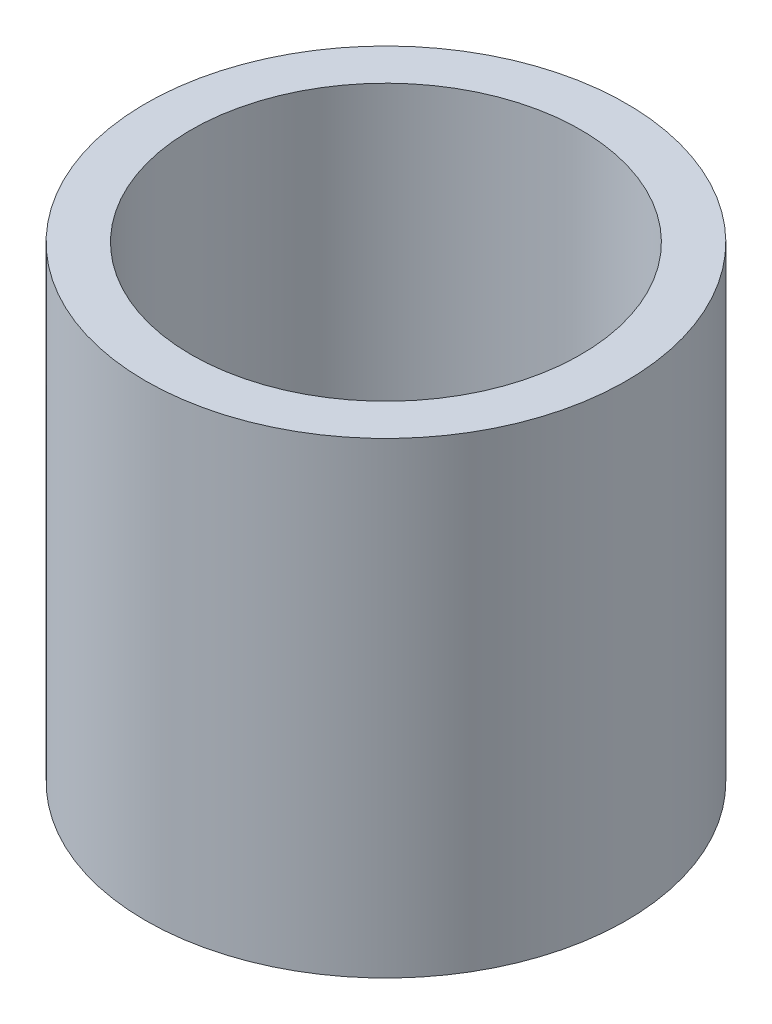
ISO-10303-21;
HEADER;
FILE_DESCRIPTION(('STEP AP214'),'2;1');
FILE_NAME('part.step','',(''),(''),'','','');
FILE_SCHEMA(('AUTOMOTIVE_DESIGN { 1 0 10303 214 1 1 1 1 }'));
ENDSEC;
DATA;
#1=APPLICATION_CONTEXT('core data for automotive mechanical design processes');
#2=APPLICATION_PROTOCOL_DEFINITION('international standard','automotive_design',2000,#1);
#3=PRODUCT_CONTEXT('',#1,'mechanical');
#4=PRODUCT('Part','Part','',(#3));
#5=PRODUCT_RELATED_PRODUCT_CATEGORY('part','',(#4));
#6=PRODUCT_DEFINITION_FORMATION('','',#4);
#7=PRODUCT_DEFINITION_CONTEXT('part definition',#1,'design');
#8=PRODUCT_DEFINITION('design','',#6,#7);
#9=PRODUCT_DEFINITION_SHAPE('','',#8);
#10=(LENGTH_UNIT() NAMED_UNIT(*) SI_UNIT(.MILLI.,.METRE.));
#11=(NAMED_UNIT(*) PLANE_ANGLE_UNIT() SI_UNIT($,.RADIAN.));
#12=(NAMED_UNIT(*) SI_UNIT($,.STERADIAN.) SOLID_ANGLE_UNIT());
#13=UNCERTAINTY_MEASURE_WITH_UNIT(LENGTH_MEASURE(1.E-05),#10,'distance_accuracy_value','');
#14=(GEOMETRIC_REPRESENTATION_CONTEXT(3) GLOBAL_UNCERTAINTY_ASSIGNED_CONTEXT((#13)) GLOBAL_UNIT_ASSIGNED_CONTEXT((#10,
#11,#12)) REPRESENTATION_CONTEXT('',''));
#15=CARTESIAN_POINT('',(0.,0.,0.));
#16=DIRECTION('',(0.,0.,1.));
#17=DIRECTION('',(1.,0.,0.));
#18=AXIS2_PLACEMENT_3D('',#15,#16,#17);
#19=CARTESIAN_POINT('',(0.,102.084634010737,0.));
#20=DIRECTION('',(0.,-1.,0.));
#21=DIRECTION('',(0.,0.,-1.));
#22=AXIS2_PLACEMENT_3D('',#19,#20,#21);
#23=CYLINDRICAL_SURFACE('',#22,52.5);
#24=CARTESIAN_POINT('',(0.,102.084634010737,0.));
#25=DIRECTION('',(0.,1.,0.));
#26=DIRECTION('',(0.,0.,1.));
#27=AXIS2_PLACEMENT_3D('',#24,#25,#26);
#28=CIRCLE('',#27,52.5);
#29=CARTESIAN_POINT('',(0.,102.084634010737,52.5));
#30=VERTEX_POINT('',#29);
#31=EDGE_CURVE('E10',#30,#30,#28,.T.);
#32=ORIENTED_EDGE('',*,*,#31,.F.);
#33=EDGE_LOOP('',(#32));
#34=FACE_BOUND('',#33,.T.);
#35=CARTESIAN_POINT('',(0.,0.,0.));
#36=DIRECTION('',(0.,1.,0.));
#37=DIRECTION('',(0.,0.,1.));
#38=AXIS2_PLACEMENT_3D('',#35,#36,#37);
#39=CIRCLE('',#38,52.5);
#40=CARTESIAN_POINT('',(0.,0.,52.5));
#41=VERTEX_POINT('',#40);
#42=EDGE_CURVE('E37',#41,#41,#39,.T.);
#43=ORIENTED_EDGE('',*,*,#42,.T.);
#44=EDGE_LOOP('',(#43));
#45=FACE_BOUND('',#44,.T.);
#46=ADVANCED_FACE('F40',(#34,#45),#23,.T.);
#47=CARTESIAN_POINT('',(0.,102.084634010737,0.));
#48=DIRECTION('',(0.,1.,0.));
#49=DIRECTION('',(0.,0.,1.));
#50=AXIS2_PLACEMENT_3D('',#47,#48,#49);
#51=PLANE('',#50);
#52=CARTESIAN_POINT('',(0.,102.084634010737,0.));
#53=DIRECTION('',(0.,1.,0.));
#54=DIRECTION('',(0.,0.,1.));
#55=AXIS2_PLACEMENT_3D('',#52,#53,#54);
#56=CIRCLE('',#55,42.5523853396472);
#57=CARTESIAN_POINT('',(0.,102.084634010737,42.5523853396472));
#58=VERTEX_POINT('',#57);
#59=EDGE_CURVE('E50',#58,#58,#56,.T.);
#60=ORIENTED_EDGE('',*,*,#59,.F.);
#61=EDGE_LOOP('',(#60));
#62=FACE_BOUND('',#61,.T.);
#63=ORIENTED_EDGE('',*,*,#31,.T.);
#64=EDGE_LOOP('',(#63));
#65=FACE_BOUND('',#64,.T.);
#66=ADVANCED_FACE('F59',(#62,#65),#51,.T.);
#67=CARTESIAN_POINT('',(0.,0.,0.));
#68=DIRECTION('',(0.,1.,0.));
#69=DIRECTION('',(0.,0.,1.));
#70=AXIS2_PLACEMENT_3D('',#67,#68,#69);
#71=PLANE('',#70);
#72=CARTESIAN_POINT('',(0.,0.,0.));
#73=DIRECTION('',(0.,1.,0.));
#74=DIRECTION('',(0.,0.,1.));
#75=AXIS2_PLACEMENT_3D('',#72,#73,#74);
#76=CIRCLE('',#75,42.5523853396472);
#77=CARTESIAN_POINT('',(0.,0.,42.5523853396472));
#78=VERTEX_POINT('',#77);
#79=EDGE_CURVE('E47',#78,#78,#76,.T.);
#80=ORIENTED_EDGE('',*,*,#79,.T.);
#81=EDGE_LOOP('',(#80));
#82=FACE_BOUND('',#81,.T.);
#83=ORIENTED_EDGE('',*,*,#42,.F.);
#84=EDGE_LOOP('',(#83));
#85=FACE_BOUND('',#84,.T.);
#86=ADVANCED_FACE('F58',(#82,#85),#71,.F.);
#87=CARTESIAN_POINT('',(0.,102.084634010737,0.));
#88=DIRECTION('',(0.,-1.,0.));
#89=DIRECTION('',(0.,0.,-1.));
#90=AXIS2_PLACEMENT_3D('',#87,#88,#89);
#91=CYLINDRICAL_SURFACE('',#90,42.5523853396472);
#92=ORIENTED_EDGE('',*,*,#59,.T.);
#93=EDGE_LOOP('',(#92));
#94=FACE_BOUND('',#93,.T.);
#95=ORIENTED_EDGE('',*,*,#79,.F.);
#96=EDGE_LOOP('',(#95));
#97=FACE_BOUND('',#96,.T.);
#98=ADVANCED_FACE('F54',(#94,#97),#91,.F.);
#99=CLOSED_SHELL('',(#46,#66,#86,#98));
#100=MANIFOLD_SOLID_BREP('B2',#99);
#101=ADVANCED_BREP_SHAPE_REPRESENTATION('',(#18,#100),#14);
#102=SHAPE_DEFINITION_REPRESENTATION(#9,#101);
ENDSEC;
END-ISO-10303-21;
